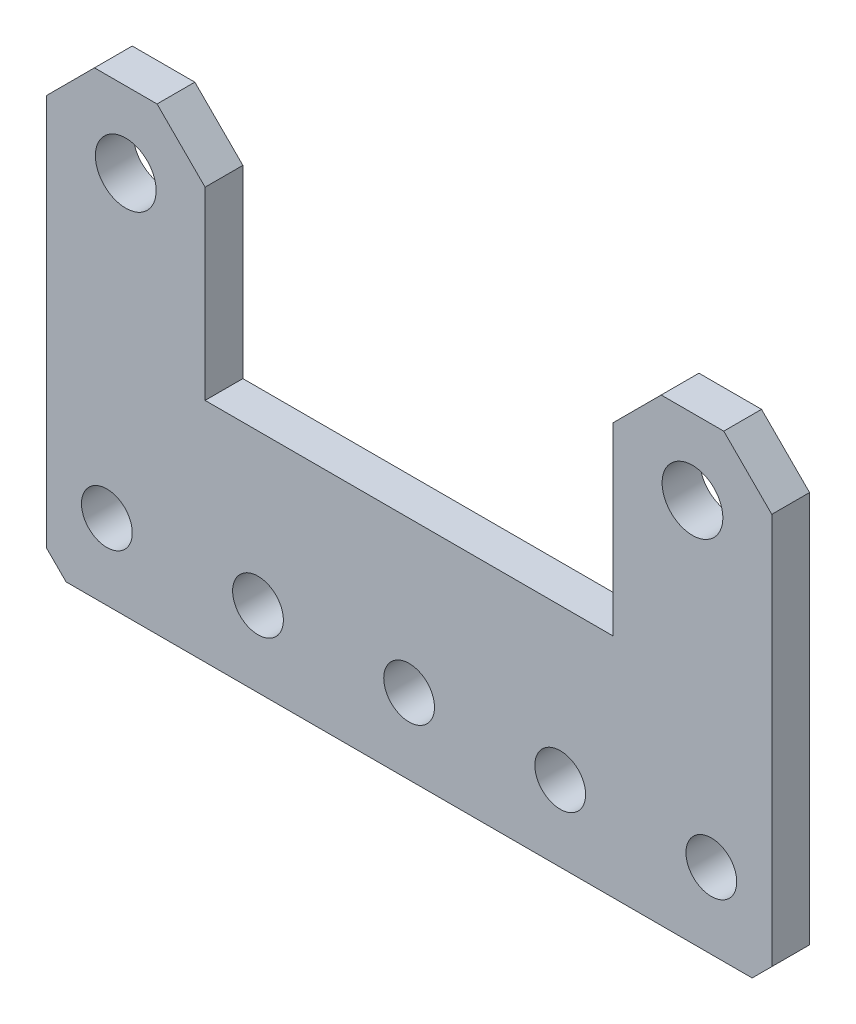
ISO-10303-21;
HEADER;
FILE_DESCRIPTION(('STEP AP214'),'2;1');
FILE_NAME('part.step','',(''),(''),'','','');
FILE_SCHEMA(('AUTOMOTIVE_DESIGN { 1 0 10303 214 1 1 1 1 }'));
ENDSEC;
DATA;
#1=APPLICATION_CONTEXT('core data for automotive mechanical design processes');
#2=APPLICATION_PROTOCOL_DEFINITION('international standard','automotive_design',2000,#1);
#3=PRODUCT_CONTEXT('',#1,'mechanical');
#4=PRODUCT('Part','Part','',(#3));
#5=PRODUCT_RELATED_PRODUCT_CATEGORY('part','',(#4));
#6=PRODUCT_DEFINITION_FORMATION('','',#4);
#7=PRODUCT_DEFINITION_CONTEXT('part definition',#1,'design');
#8=PRODUCT_DEFINITION('design','',#6,#7);
#9=PRODUCT_DEFINITION_SHAPE('','',#8);
#10=(LENGTH_UNIT() NAMED_UNIT(*) SI_UNIT(.MILLI.,.METRE.));
#11=(NAMED_UNIT(*) PLANE_ANGLE_UNIT() SI_UNIT($,.RADIAN.));
#12=(NAMED_UNIT(*) SI_UNIT($,.STERADIAN.) SOLID_ANGLE_UNIT());
#13=UNCERTAINTY_MEASURE_WITH_UNIT(LENGTH_MEASURE(1.E-05),#10,'distance_accuracy_value','');
#14=(GEOMETRIC_REPRESENTATION_CONTEXT(3) GLOBAL_UNCERTAINTY_ASSIGNED_CONTEXT((#13)) GLOBAL_UNIT_ASSIGNED_CONTEXT((#10,
#11,#12)) REPRESENTATION_CONTEXT('',''));
#15=CARTESIAN_POINT('',(0.,0.,0.));
#16=DIRECTION('',(0.,0.,1.));
#17=DIRECTION('',(1.,0.,0.));
#18=AXIS2_PLACEMENT_3D('',#15,#16,#17);
#19=CARTESIAN_POINT('',(0.,0.,0.));
#20=DIRECTION('',(0.,0.,1.));
#21=DIRECTION('',(1.,0.,0.));
#22=AXIS2_PLACEMENT_3D('',#19,#20,#21);
#23=PLANE('',#22);
#24=CARTESIAN_POINT('',(25.4,-12.7,0.));
#25=DIRECTION('',(0.,0.,-1.));
#26=DIRECTION('',(-1.,0.,0.));
#27=AXIS2_PLACEMENT_3D('',#24,#25,#26);
#28=CIRCLE('',#27,2.1336);
#29=CARTESIAN_POINT('',(23.2664,-12.7,0.));
#30=VERTEX_POINT('',#29);
#31=EDGE_CURVE('E163',#30,#30,#28,.F.);
#32=ORIENTED_EDGE('',*,*,#31,.T.);
#33=EDGE_LOOP('',(#32));
#34=FACE_BOUND('',#33,.T.);
#35=CARTESIAN_POINT('',(12.7,-12.7,0.));
#36=DIRECTION('',(0.,0.,-1.));
#37=DIRECTION('',(-1.,0.,0.));
#38=AXIS2_PLACEMENT_3D('',#35,#36,#37);
#39=CIRCLE('',#38,2.1336);
#40=CARTESIAN_POINT('',(10.5664,-12.7,0.));
#41=VERTEX_POINT('',#40);
#42=EDGE_CURVE('E20',#41,#41,#39,.F.);
#43=ORIENTED_EDGE('',*,*,#42,.T.);
#44=EDGE_LOOP('',(#43));
#45=FACE_BOUND('',#44,.T.);
#46=CARTESIAN_POINT('',(0.,-12.7,0.));
#47=DIRECTION('',(0.,0.,-1.));
#48=DIRECTION('',(-1.,0.,0.));
#49=AXIS2_PLACEMENT_3D('',#46,#47,#48);
#50=CIRCLE('',#49,2.1336);
#51=CARTESIAN_POINT('',(-2.1336,-12.7,0.));
#52=VERTEX_POINT('',#51);
#53=EDGE_CURVE('E166',#52,#52,#50,.F.);
#54=ORIENTED_EDGE('',*,*,#53,.T.);
#55=EDGE_LOOP('',(#54));
#56=FACE_BOUND('',#55,.T.);
#57=CARTESIAN_POINT('',(-12.7,-12.7,0.));
#58=DIRECTION('',(0.,0.,-1.));
#59=DIRECTION('',(-1.,0.,0.));
#60=AXIS2_PLACEMENT_3D('',#57,#58,#59);
#61=CIRCLE('',#60,2.1336);
#62=CARTESIAN_POINT('',(-14.8336,-12.7,0.));
#63=VERTEX_POINT('',#62);
#64=EDGE_CURVE('E177',#63,#63,#61,.F.);
#65=ORIENTED_EDGE('',*,*,#64,.T.);
#66=EDGE_LOOP('',(#65));
#67=FACE_BOUND('',#66,.T.);
#68=CARTESIAN_POINT('',(-25.4,-12.7,0.));
#69=DIRECTION('',(0.,0.,-1.));
#70=DIRECTION('',(-1.,0.,0.));
#71=AXIS2_PLACEMENT_3D('',#68,#69,#70);
#72=CIRCLE('',#71,2.1336);
#73=CARTESIAN_POINT('',(-27.5336,-12.7,0.));
#74=VERTEX_POINT('',#73);
#75=EDGE_CURVE('E169',#74,#74,#72,.F.);
#76=ORIENTED_EDGE('',*,*,#75,.T.);
#77=EDGE_LOOP('',(#76));
#78=FACE_BOUND('',#77,.T.);
#79=CARTESIAN_POINT('',(23.8125,13.208,0.));
#80=DIRECTION('',(0.,0.,-1.));
#81=DIRECTION('',(-1.,0.,0.));
#82=AXIS2_PLACEMENT_3D('',#79,#80,#81);
#83=CIRCLE('',#82,2.5527);
#84=CARTESIAN_POINT('',(21.2598,13.208,0.));
#85=VERTEX_POINT('',#84);
#86=EDGE_CURVE('E133',#85,#85,#83,.F.);
#87=ORIENTED_EDGE('',*,*,#86,.T.);
#88=EDGE_LOOP('',(#87));
#89=FACE_BOUND('',#88,.T.);
#90=CARTESIAN_POINT('',(-23.8125,13.208,0.));
#91=DIRECTION('',(0.,0.,-1.));
#92=DIRECTION('',(-1.,0.,0.));
#93=AXIS2_PLACEMENT_3D('',#90,#91,#92);
#94=CIRCLE('',#93,2.5527);
#95=CARTESIAN_POINT('',(-26.3652,13.208,0.));
#96=VERTEX_POINT('',#95);
#97=EDGE_CURVE('E172',#96,#96,#94,.F.);
#98=ORIENTED_EDGE('',*,*,#97,.T.);
#99=EDGE_LOOP('',(#98));
#100=FACE_BOUND('',#99,.T.);
#101=DIRECTION('',(-0.707106781186545,0.70710678118655,0.));
#102=VECTOR('',#101,1.);
#103=CARTESIAN_POINT('',(-28.829,-19.05,0.));
#104=LINE('',#103,#102);
#105=CARTESIAN_POINT('',(-28.829,-19.05,0.));
#106=VERTEX_POINT('',#105);
#107=CARTESIAN_POINT('',(-30.48,-17.399,0.));
#108=VERTEX_POINT('',#107);
#109=EDGE_CURVE('E117',#106,#108,#104,.T.);
#110=ORIENTED_EDGE('',*,*,#109,.T.);
#111=DIRECTION('',(0.,1.,0.));
#112=VECTOR('',#111,1.);
#113=CARTESIAN_POINT('',(-30.48,15.5207561210691,0.));
#114=LINE('',#113,#112);
#115=CARTESIAN_POINT('',(-30.48,15.5207561210691,0.));
#116=VERTEX_POINT('',#115);
#117=EDGE_CURVE('E120',#108,#116,#114,.T.);
#118=ORIENTED_EDGE('',*,*,#117,.T.);
#119=DIRECTION('',(0.707106781186544,0.707106781186551,0.));
#120=VECTOR('',#119,1.);
#121=CARTESIAN_POINT('',(-26.4427561210692,19.558,0.));
#122=LINE('',#121,#120);
#123=CARTESIAN_POINT('',(-26.4427561210692,19.558,0.));
#124=VERTEX_POINT('',#123);
#125=EDGE_CURVE('E175',#116,#124,#122,.T.);
#126=ORIENTED_EDGE('',*,*,#125,.T.);
#127=DIRECTION('',(1.,0.,0.));
#128=VECTOR('',#127,1.);
#129=CARTESIAN_POINT('',(-21.1822438789308,19.558,0.));
#130=LINE('',#129,#128);
#131=CARTESIAN_POINT('',(-21.1822438789308,19.558,0.));
#132=VERTEX_POINT('',#131);
#133=EDGE_CURVE('E480',#124,#132,#130,.T.);
#134=ORIENTED_EDGE('',*,*,#133,.T.);
#135=DIRECTION('',(0.707106781186546,-0.707106781186549,0.));
#136=VECTOR('',#135,1.);
#137=CARTESIAN_POINT('',(-21.1822438789308,19.558,0.));
#138=LINE('',#137,#136);
#139=CARTESIAN_POINT('',(-17.145,15.5207561210691,0.));
#140=VERTEX_POINT('',#139);
#141=EDGE_CURVE('E475',#132,#140,#138,.T.);
#142=ORIENTED_EDGE('',*,*,#141,.T.);
#143=DIRECTION('',(0.,1.,0.));
#144=VECTOR('',#143,1.);
#145=CARTESIAN_POINT('',(-17.145,15.5207561210691,0.));
#146=LINE('',#145,#144);
#147=CARTESIAN_POINT('',(-17.145,0.,0.));
#148=VERTEX_POINT('',#147);
#149=EDGE_CURVE('E470',#140,#148,#146,.F.);
#150=ORIENTED_EDGE('',*,*,#149,.T.);
#151=DIRECTION('',(1.,0.,0.));
#152=VECTOR('',#151,1.);
#153=CARTESIAN_POINT('',(-17.145,0.,0.));
#154=LINE('',#153,#152);
#155=CARTESIAN_POINT('',(17.145,0.,0.));
#156=VERTEX_POINT('',#155);
#157=EDGE_CURVE('E465',#148,#156,#154,.T.);
#158=ORIENTED_EDGE('',*,*,#157,.T.);
#159=DIRECTION('',(0.,1.,0.));
#160=VECTOR('',#159,1.);
#161=CARTESIAN_POINT('',(17.145,0.,0.));
#162=LINE('',#161,#160);
#163=CARTESIAN_POINT('',(17.145,15.5207561210692,0.));
#164=VERTEX_POINT('',#163);
#165=EDGE_CURVE('E460',#156,#164,#162,.T.);
#166=ORIENTED_EDGE('',*,*,#165,.T.);
#167=DIRECTION('',(0.707106781186547,0.707106781186548,0.));
#168=VECTOR('',#167,1.);
#169=CARTESIAN_POINT('',(17.145,15.5207561210692,0.));
#170=LINE('',#169,#168);
#171=CARTESIAN_POINT('',(21.1822438789308,19.558,0.));
#172=VERTEX_POINT('',#171);
#173=EDGE_CURVE('E455',#164,#172,#170,.T.);
#174=ORIENTED_EDGE('',*,*,#173,.T.);
#175=DIRECTION('',(1.,0.,0.));
#176=VECTOR('',#175,1.);
#177=CARTESIAN_POINT('',(26.4427561210692,19.558,0.));
#178=LINE('',#177,#176);
#179=CARTESIAN_POINT('',(26.4427561210692,19.558,0.));
#180=VERTEX_POINT('',#179);
#181=EDGE_CURVE('E450',#172,#180,#178,.T.);
#182=ORIENTED_EDGE('',*,*,#181,.T.);
#183=DIRECTION('',(0.707106781186544,-0.707106781186551,0.));
#184=VECTOR('',#183,1.);
#185=CARTESIAN_POINT('',(30.48,15.5207561210691,0.));
#186=LINE('',#185,#184);
#187=CARTESIAN_POINT('',(30.48,15.5207561210691,0.));
#188=VERTEX_POINT('',#187);
#189=EDGE_CURVE('E445',#180,#188,#186,.T.);
#190=ORIENTED_EDGE('',*,*,#189,.T.);
#191=DIRECTION('',(0.,-1.,0.));
#192=VECTOR('',#191,1.);
#193=CARTESIAN_POINT('',(30.48,-19.05,0.));
#194=LINE('',#193,#192);
#195=CARTESIAN_POINT('',(30.48,-17.399,0.));
#196=VERTEX_POINT('',#195);
#197=EDGE_CURVE('E439',#188,#196,#194,.T.);
#198=ORIENTED_EDGE('',*,*,#197,.T.);
#199=DIRECTION('',(-0.70710678118655,-0.707106781186545,0.));
#200=VECTOR('',#199,1.);
#201=CARTESIAN_POINT('',(30.48,-17.399,0.));
#202=LINE('',#201,#200);
#203=CARTESIAN_POINT('',(28.829,-19.05,0.));
#204=VERTEX_POINT('',#203);
#205=EDGE_CURVE('E434',#196,#204,#202,.T.);
#206=ORIENTED_EDGE('',*,*,#205,.T.);
#207=DIRECTION('',(1.,0.,0.));
#208=VECTOR('',#207,1.);
#209=CARTESIAN_POINT('',(-30.48,-19.05,0.));
#210=LINE('',#209,#208);
#211=EDGE_CURVE('E115',#204,#106,#210,.F.);
#212=ORIENTED_EDGE('',*,*,#211,.T.);
#213=EDGE_LOOP('',(#110,#118,#126,#134,#142,#150,#158,#166,#174,#182,#190,#198,#206,#212));
#214=FACE_BOUND('',#213,.T.);
#215=ADVANCED_FACE('F17',(#34,#45,#56,#67,#78,#89,#100,#214),#23,.F.);
#216=CARTESIAN_POINT('',(12.7,-12.7,3.175));
#217=DIRECTION('',(0.,0.,-1.));
#218=DIRECTION('',(-1.,0.,0.));
#219=AXIS2_PLACEMENT_3D('',#216,#217,#218);
#220=CYLINDRICAL_SURFACE('',#219,2.1336);
#221=CARTESIAN_POINT('',(12.7,-12.7,3.175));
#222=DIRECTION('',(0.,0.,-1.));
#223=DIRECTION('',(-1.,0.,0.));
#224=AXIS2_PLACEMENT_3D('',#221,#222,#223);
#225=CIRCLE('',#224,2.1336);
#226=CARTESIAN_POINT('',(10.5664,-12.7,3.175));
#227=VERTEX_POINT('',#226);
#228=EDGE_CURVE('E160',#227,#227,#225,.T.);
#229=ORIENTED_EDGE('',*,*,#228,.F.);
#230=EDGE_LOOP('',(#229));
#231=FACE_BOUND('',#230,.T.);
#232=ORIENTED_EDGE('',*,*,#42,.F.);
#233=EDGE_LOOP('',(#232));
#234=FACE_BOUND('',#233,.T.);
#235=ADVANCED_FACE('F186',(#231,#234),#220,.F.);
#236=CARTESIAN_POINT('',(-12.7,-12.7,3.175));
#237=DIRECTION('',(0.,0.,-1.));
#238=DIRECTION('',(-1.,0.,0.));
#239=AXIS2_PLACEMENT_3D('',#236,#237,#238);
#240=CYLINDRICAL_SURFACE('',#239,2.1336);
#241=CARTESIAN_POINT('',(-12.7,-12.7,3.175));
#242=DIRECTION('',(0.,0.,-1.));
#243=DIRECTION('',(-1.,0.,0.));
#244=AXIS2_PLACEMENT_3D('',#241,#242,#243);
#245=CIRCLE('',#244,2.1336);
#246=CARTESIAN_POINT('',(-14.8336,-12.7,3.175));
#247=VERTEX_POINT('',#246);
#248=EDGE_CURVE('E157',#247,#247,#245,.T.);
#249=ORIENTED_EDGE('',*,*,#248,.F.);
#250=EDGE_LOOP('',(#249));
#251=FACE_BOUND('',#250,.T.);
#252=ORIENTED_EDGE('',*,*,#64,.F.);
#253=EDGE_LOOP('',(#252));
#254=FACE_BOUND('',#253,.T.);
#255=ADVANCED_FACE('F188',(#251,#254),#240,.F.);
#256=CARTESIAN_POINT('',(23.8125,13.208,3.175));
#257=DIRECTION('',(0.,0.,-1.));
#258=DIRECTION('',(-1.,0.,0.));
#259=AXIS2_PLACEMENT_3D('',#256,#257,#258);
#260=CYLINDRICAL_SURFACE('',#259,2.5527);
#261=CARTESIAN_POINT('',(23.8125,13.208,3.175));
#262=DIRECTION('',(0.,0.,-1.));
#263=DIRECTION('',(-1.,0.,0.));
#264=AXIS2_PLACEMENT_3D('',#261,#262,#263);
#265=CIRCLE('',#264,2.5527);
#266=CARTESIAN_POINT('',(21.2598,13.208,3.175));
#267=VERTEX_POINT('',#266);
#268=EDGE_CURVE('E153',#267,#267,#265,.T.);
#269=ORIENTED_EDGE('',*,*,#268,.F.);
#270=EDGE_LOOP('',(#269));
#271=FACE_BOUND('',#270,.T.);
#272=ORIENTED_EDGE('',*,*,#86,.F.);
#273=EDGE_LOOP('',(#272));
#274=FACE_BOUND('',#273,.T.);
#275=ADVANCED_FACE('F195',(#271,#274),#260,.F.);
#276=CARTESIAN_POINT('',(-30.48,15.5207561210691,3.175));
#277=DIRECTION('',(1.,0.,0.));
#278=DIRECTION('',(0.,1.,0.));
#279=AXIS2_PLACEMENT_3D('',#276,#277,#278);
#280=PLANE('',#279);
#281=DIRECTION('',(0.,0.,1.));
#282=VECTOR('',#281,1.);
#283=CARTESIAN_POINT('',(-30.48,-17.399,3.175));
#284=LINE('',#283,#282);
#285=CARTESIAN_POINT('',(-30.48,-17.399,3.175));
#286=VERTEX_POINT('',#285);
#287=EDGE_CURVE('E125',#108,#286,#284,.T.);
#288=ORIENTED_EDGE('',*,*,#287,.T.);
#289=DIRECTION('',(0.,1.,0.));
#290=VECTOR('',#289,1.);
#291=CARTESIAN_POINT('',(-30.48,0.,3.175));
#292=LINE('',#291,#290);
#293=CARTESIAN_POINT('',(-30.48,15.5207561210691,3.175));
#294=VERTEX_POINT('',#293);
#295=EDGE_CURVE('E156',#294,#286,#292,.F.);
#296=ORIENTED_EDGE('',*,*,#295,.F.);
#297=DIRECTION('',(0.,0.,1.));
#298=VECTOR('',#297,1.);
#299=CARTESIAN_POINT('',(-30.48,15.5207561210691,3.175));
#300=LINE('',#299,#298);
#301=EDGE_CURVE('E131',#294,#116,#300,.F.);
#302=ORIENTED_EDGE('',*,*,#301,.T.);
#303=ORIENTED_EDGE('',*,*,#117,.F.);
#304=EDGE_LOOP('',(#288,#296,#302,#303));
#305=FACE_BOUND('',#304,.T.);
#306=ADVANCED_FACE('F128',(#305),#280,.F.);
#307=CARTESIAN_POINT('',(-28.829,-19.05,3.175));
#308=DIRECTION('',(0.70710678118655,0.707106781186545,0.));
#309=DIRECTION('',(-0.707106781186545,0.70710678118655,0.));
#310=AXIS2_PLACEMENT_3D('',#307,#308,#309);
#311=PLANE('',#310);
#312=ORIENTED_EDGE('',*,*,#287,.F.);
#313=ORIENTED_EDGE('',*,*,#109,.F.);
#314=DIRECTION('',(0.,0.,1.));
#315=VECTOR('',#314,1.);
#316=CARTESIAN_POINT('',(-28.829,-19.05,3.175));
#317=LINE('',#316,#315);
#318=CARTESIAN_POINT('',(-28.829,-19.05,3.175));
#319=VERTEX_POINT('',#318);
#320=EDGE_CURVE('E140',#106,#319,#317,.T.);
#321=ORIENTED_EDGE('',*,*,#320,.T.);
#322=DIRECTION('',(0.707106781186545,-0.70710678118655,0.));
#323=VECTOR('',#322,1.);
#324=CARTESIAN_POINT('',(-30.48,-17.399,3.175));
#325=LINE('',#324,#323);
#326=EDGE_CURVE('E137',#286,#319,#325,.T.);
#327=ORIENTED_EDGE('',*,*,#326,.F.);
#328=EDGE_LOOP('',(#312,#313,#321,#327));
#329=FACE_BOUND('',#328,.T.);
#330=ADVANCED_FACE('F135',(#329),#311,.F.);
#331=CARTESIAN_POINT('',(-30.48,-19.05,3.175));
#332=DIRECTION('',(0.,1.,0.));
#333=DIRECTION('',(0.,0.,1.));
#334=AXIS2_PLACEMENT_3D('',#331,#332,#333);
#335=PLANE('',#334);
#336=ORIENTED_EDGE('',*,*,#320,.F.);
#337=ORIENTED_EDGE('',*,*,#211,.F.);
#338=DIRECTION('',(0.,0.,1.));
#339=VECTOR('',#338,1.);
#340=CARTESIAN_POINT('',(28.829,-19.05,3.175));
#341=LINE('',#340,#339);
#342=CARTESIAN_POINT('',(28.829,-19.05,3.175));
#343=VERTEX_POINT('',#342);
#344=EDGE_CURVE('E435',#204,#343,#341,.T.);
#345=ORIENTED_EDGE('',*,*,#344,.T.);
#346=DIRECTION('',(1.,0.,0.));
#347=VECTOR('',#346,1.);
#348=CARTESIAN_POINT('',(0.,-19.05,3.175));
#349=LINE('',#348,#347);
#350=EDGE_CURVE('E433',#319,#343,#349,.T.);
#351=ORIENTED_EDGE('',*,*,#350,.F.);
#352=EDGE_LOOP('',(#336,#337,#345,#351));
#353=FACE_BOUND('',#352,.T.);
#354=ADVANCED_FACE('F266',(#353),#335,.F.);
#355=CARTESIAN_POINT('',(30.48,-17.399,3.175));
#356=DIRECTION('',(-0.707106781186545,0.70710678118655,0.));
#357=DIRECTION('',(-0.70710678118655,-0.707106781186545,0.));
#358=AXIS2_PLACEMENT_3D('',#355,#356,#357);
#359=PLANE('',#358);
#360=ORIENTED_EDGE('',*,*,#344,.F.);
#361=ORIENTED_EDGE('',*,*,#205,.F.);
#362=DIRECTION('',(0.,0.,1.));
#363=VECTOR('',#362,1.);
#364=CARTESIAN_POINT('',(30.48,-17.399,3.175));
#365=LINE('',#364,#363);
#366=CARTESIAN_POINT('',(30.48,-17.399,3.175));
#367=VERTEX_POINT('',#366);
#368=EDGE_CURVE('E441',#196,#367,#365,.T.);
#369=ORIENTED_EDGE('',*,*,#368,.T.);
#370=DIRECTION('',(0.707106781186553,0.707106781186542,0.));
#371=VECTOR('',#370,1.);
#372=CARTESIAN_POINT('',(28.829,-19.05,3.175));
#373=LINE('',#372,#371);
#374=EDGE_CURVE('E489',#343,#367,#373,.T.);
#375=ORIENTED_EDGE('',*,*,#374,.F.);
#376=EDGE_LOOP('',(#360,#361,#369,#375));
#377=FACE_BOUND('',#376,.T.);
#378=ADVANCED_FACE('F262',(#377),#359,.F.);
#379=CARTESIAN_POINT('',(30.48,-19.05,3.175));
#380=DIRECTION('',(-1.,0.,0.));
#381=DIRECTION('',(0.,-1.,0.));
#382=AXIS2_PLACEMENT_3D('',#379,#380,#381);
#383=PLANE('',#382);
#384=ORIENTED_EDGE('',*,*,#368,.F.);
#385=ORIENTED_EDGE('',*,*,#197,.F.);
#386=DIRECTION('',(0.,0.,1.));
#387=VECTOR('',#386,1.);
#388=CARTESIAN_POINT('',(30.48,15.5207561210691,3.175));
#389=LINE('',#388,#387);
#390=CARTESIAN_POINT('',(30.48,15.5207561210691,3.175));
#391=VERTEX_POINT('',#390);
#392=EDGE_CURVE('E443',#188,#391,#389,.T.);
#393=ORIENTED_EDGE('',*,*,#392,.T.);
#394=DIRECTION('',(0.,1.,0.));
#395=VECTOR('',#394,1.);
#396=CARTESIAN_POINT('',(30.48,0.,3.175));
#397=LINE('',#396,#395);
#398=EDGE_CURVE('E492',#367,#391,#397,.T.);
#399=ORIENTED_EDGE('',*,*,#398,.F.);
#400=EDGE_LOOP('',(#384,#385,#393,#399));
#401=FACE_BOUND('',#400,.T.);
#402=ADVANCED_FACE('F258',(#401),#383,.F.);
#403=CARTESIAN_POINT('',(30.48,15.5207561210691,3.175));
#404=DIRECTION('',(-0.707106781186551,-0.707106781186544,0.));
#405=DIRECTION('',(0.707106781186544,-0.707106781186551,0.));
#406=AXIS2_PLACEMENT_3D('',#403,#404,#405);
#407=PLANE('',#406);
#408=DIRECTION('',(0.,0.,1.));
#409=VECTOR('',#408,1.);
#410=CARTESIAN_POINT('',(26.4427561210692,19.558,3.175));
#411=LINE('',#410,#409);
#412=CARTESIAN_POINT('',(26.4427561210692,19.558,3.175));
#413=VERTEX_POINT('',#412);
#414=EDGE_CURVE('E448',#180,#413,#411,.T.);
#415=ORIENTED_EDGE('',*,*,#414,.T.);
#416=DIRECTION('',(-0.707106781186544,0.707106781186551,0.));
#417=VECTOR('',#416,1.);
#418=CARTESIAN_POINT('',(30.48,15.5207561210691,3.175));
#419=LINE('',#418,#417);
#420=EDGE_CURVE('E495',#391,#413,#419,.T.);
#421=ORIENTED_EDGE('',*,*,#420,.F.);
#422=ORIENTED_EDGE('',*,*,#392,.F.);
#423=ORIENTED_EDGE('',*,*,#189,.F.);
#424=EDGE_LOOP('',(#415,#421,#422,#423));
#425=FACE_BOUND('',#424,.T.);
#426=ADVANCED_FACE('F254',(#425),#407,.F.);
#427=CARTESIAN_POINT('',(26.4427561210692,19.558,3.175));
#428=DIRECTION('',(0.,-1.,0.));
#429=DIRECTION('',(1.,0.,0.));
#430=AXIS2_PLACEMENT_3D('',#427,#428,#429);
#431=PLANE('',#430);
#432=DIRECTION('',(0.,0.,1.));
#433=VECTOR('',#432,1.);
#434=CARTESIAN_POINT('',(21.1822438789308,19.558,3.175));
#435=LINE('',#434,#433);
#436=CARTESIAN_POINT('',(21.1822438789308,19.558,3.175));
#437=VERTEX_POINT('',#436);
#438=EDGE_CURVE('E453',#172,#437,#435,.T.);
#439=ORIENTED_EDGE('',*,*,#438,.T.);
#440=DIRECTION('',(1.,0.,0.));
#441=VECTOR('',#440,1.);
#442=CARTESIAN_POINT('',(0.,19.558,3.175));
#443=LINE('',#442,#441);
#444=EDGE_CURVE('E498',#413,#437,#443,.F.);
#445=ORIENTED_EDGE('',*,*,#444,.F.);
#446=ORIENTED_EDGE('',*,*,#414,.F.);
#447=ORIENTED_EDGE('',*,*,#181,.F.);
#448=EDGE_LOOP('',(#439,#445,#446,#447));
#449=FACE_BOUND('',#448,.T.);
#450=ADVANCED_FACE('F250',(#449),#431,.F.);
#451=CARTESIAN_POINT('',(17.145,15.5207561210692,3.175));
#452=DIRECTION('',(0.707106781186548,-0.707106781186547,0.));
#453=DIRECTION('',(0.707106781186547,0.707106781186548,0.));
#454=AXIS2_PLACEMENT_3D('',#451,#452,#453);
#455=PLANE('',#454);
#456=DIRECTION('',(0.,0.,-1.));
#457=VECTOR('',#456,1.);
#458=CARTESIAN_POINT('',(17.145,15.5207561210692,3.175));
#459=LINE('',#458,#457);
#460=CARTESIAN_POINT('',(17.145,15.5207561210692,3.175));
#461=VERTEX_POINT('',#460);
#462=EDGE_CURVE('E458',#164,#461,#459,.F.);
#463=ORIENTED_EDGE('',*,*,#462,.T.);
#464=DIRECTION('',(-0.707106781186547,-0.707106781186548,0.));
#465=VECTOR('',#464,1.);
#466=CARTESIAN_POINT('',(21.1822438789308,19.558,3.175));
#467=LINE('',#466,#465);
#468=EDGE_CURVE('E501',#437,#461,#467,.T.);
#469=ORIENTED_EDGE('',*,*,#468,.F.);
#470=ORIENTED_EDGE('',*,*,#438,.F.);
#471=ORIENTED_EDGE('',*,*,#173,.F.);
#472=EDGE_LOOP('',(#463,#469,#470,#471));
#473=FACE_BOUND('',#472,.T.);
#474=ADVANCED_FACE('F246',(#473),#455,.F.);
#475=CARTESIAN_POINT('',(17.145,0.,3.175));
#476=DIRECTION('',(1.,0.,0.));
#477=DIRECTION('',(0.,0.,-1.));
#478=AXIS2_PLACEMENT_3D('',#475,#476,#477);
#479=PLANE('',#478);
#480=DIRECTION('',(0.,0.,-1.));
#481=VECTOR('',#480,1.);
#482=CARTESIAN_POINT('',(17.145,0.,3.175));
#483=LINE('',#482,#481);
#484=CARTESIAN_POINT('',(17.145,0.,3.175));
#485=VERTEX_POINT('',#484);
#486=EDGE_CURVE('E463',#156,#485,#483,.F.);
#487=ORIENTED_EDGE('',*,*,#486,.T.);
#488=DIRECTION('',(0.,1.,0.));
#489=VECTOR('',#488,1.);
#490=CARTESIAN_POINT('',(17.145,0.,3.175));
#491=LINE('',#490,#489);
#492=EDGE_CURVE('E504',#461,#485,#491,.F.);
#493=ORIENTED_EDGE('',*,*,#492,.F.);
#494=ORIENTED_EDGE('',*,*,#462,.F.);
#495=ORIENTED_EDGE('',*,*,#165,.F.);
#496=EDGE_LOOP('',(#487,#493,#494,#495));
#497=FACE_BOUND('',#496,.T.);
#498=ADVANCED_FACE('F242',(#497),#479,.F.);
#499=CARTESIAN_POINT('',(-17.145,0.,3.175));
#500=DIRECTION('',(0.,-1.,0.));
#501=DIRECTION('',(0.,0.,-1.));
#502=AXIS2_PLACEMENT_3D('',#499,#500,#501);
#503=PLANE('',#502);
#504=DIRECTION('',(0.,0.,1.));
#505=VECTOR('',#504,1.);
#506=CARTESIAN_POINT('',(-17.145,0.,3.175));
#507=LINE('',#506,#505);
#508=CARTESIAN_POINT('',(-17.145,0.,3.175));
#509=VERTEX_POINT('',#508);
#510=EDGE_CURVE('E468',#148,#509,#507,.T.);
#511=ORIENTED_EDGE('',*,*,#510,.T.);
#512=DIRECTION('',(1.,0.,0.));
#513=VECTOR('',#512,1.);
#514=CARTESIAN_POINT('',(0.,0.,3.175));
#515=LINE('',#514,#513);
#516=EDGE_CURVE('E507',#485,#509,#515,.F.);
#517=ORIENTED_EDGE('',*,*,#516,.F.);
#518=ORIENTED_EDGE('',*,*,#486,.F.);
#519=ORIENTED_EDGE('',*,*,#157,.F.);
#520=EDGE_LOOP('',(#511,#517,#518,#519));
#521=FACE_BOUND('',#520,.T.);
#522=ADVANCED_FACE('F238',(#521),#503,.F.);
#523=CARTESIAN_POINT('',(-17.145,15.5207561210691,3.175));
#524=DIRECTION('',(-1.,0.,0.));
#525=DIRECTION('',(0.,0.,1.));
#526=AXIS2_PLACEMENT_3D('',#523,#524,#525);
#527=PLANE('',#526);
#528=DIRECTION('',(0.,0.,1.));
#529=VECTOR('',#528,1.);
#530=CARTESIAN_POINT('',(-17.145,15.5207561210691,3.175));
#531=LINE('',#530,#529);
#532=CARTESIAN_POINT('',(-17.145,15.5207561210691,3.175));
#533=VERTEX_POINT('',#532);
#534=EDGE_CURVE('E473',#140,#533,#531,.T.);
#535=ORIENTED_EDGE('',*,*,#534,.T.);
#536=DIRECTION('',(0.,1.,0.));
#537=VECTOR('',#536,1.);
#538=CARTESIAN_POINT('',(-17.145,0.,3.175));
#539=LINE('',#538,#537);
#540=EDGE_CURVE('E510',#509,#533,#539,.T.);
#541=ORIENTED_EDGE('',*,*,#540,.F.);
#542=ORIENTED_EDGE('',*,*,#510,.F.);
#543=ORIENTED_EDGE('',*,*,#149,.F.);
#544=EDGE_LOOP('',(#535,#541,#542,#543));
#545=FACE_BOUND('',#544,.T.);
#546=ADVANCED_FACE('F234',(#545),#527,.F.);
#547=CARTESIAN_POINT('',(-21.1822438789308,19.558,3.175));
#548=DIRECTION('',(-0.707106781186549,-0.707106781186546,0.));
#549=DIRECTION('',(0.707106781186546,-0.707106781186549,0.));
#550=AXIS2_PLACEMENT_3D('',#547,#548,#549);
#551=PLANE('',#550);
#552=DIRECTION('',(0.,0.,-1.));
#553=VECTOR('',#552,1.);
#554=CARTESIAN_POINT('',(-21.1822438789308,19.558,3.175));
#555=LINE('',#554,#553);
#556=CARTESIAN_POINT('',(-21.1822438789308,19.558,3.175));
#557=VERTEX_POINT('',#556);
#558=EDGE_CURVE('E478',#132,#557,#555,.F.);
#559=ORIENTED_EDGE('',*,*,#558,.T.);
#560=DIRECTION('',(-0.707106781186546,0.707106781186549,0.));
#561=VECTOR('',#560,1.);
#562=CARTESIAN_POINT('',(-17.145,15.5207561210691,3.175));
#563=LINE('',#562,#561);
#564=EDGE_CURVE('E513',#533,#557,#563,.T.);
#565=ORIENTED_EDGE('',*,*,#564,.F.);
#566=ORIENTED_EDGE('',*,*,#534,.F.);
#567=ORIENTED_EDGE('',*,*,#141,.F.);
#568=EDGE_LOOP('',(#559,#565,#566,#567));
#569=FACE_BOUND('',#568,.T.);
#570=ADVANCED_FACE('F231',(#569),#551,.F.);
#571=CARTESIAN_POINT('',(-21.1822438789308,19.558,3.175));
#572=DIRECTION('',(0.,-1.,0.));
#573=DIRECTION('',(0.,0.,-1.));
#574=AXIS2_PLACEMENT_3D('',#571,#572,#573);
#575=PLANE('',#574);
#576=DIRECTION('',(0.,0.,1.));
#577=VECTOR('',#576,1.);
#578=CARTESIAN_POINT('',(-26.4427561210692,19.558,3.175));
#579=LINE('',#578,#577);
#580=CARTESIAN_POINT('',(-26.4427561210692,19.558,3.175));
#581=VERTEX_POINT('',#580);
#582=EDGE_CURVE('E35',#124,#581,#579,.T.);
#583=ORIENTED_EDGE('',*,*,#582,.T.);
#584=DIRECTION('',(1.,0.,0.));
#585=VECTOR('',#584,1.);
#586=CARTESIAN_POINT('',(0.,19.558,3.175));
#587=LINE('',#586,#585);
#588=EDGE_CURVE('E516',#557,#581,#587,.F.);
#589=ORIENTED_EDGE('',*,*,#588,.F.);
#590=ORIENTED_EDGE('',*,*,#558,.F.);
#591=ORIENTED_EDGE('',*,*,#133,.F.);
#592=EDGE_LOOP('',(#583,#589,#590,#591));
#593=FACE_BOUND('',#592,.T.);
#594=ADVANCED_FACE('F227',(#593),#575,.F.);
#595=CARTESIAN_POINT('',(-26.4427561210692,19.558,3.175));
#596=DIRECTION('',(0.707106781186551,-0.707106781186544,0.));
#597=DIRECTION('',(0.707106781186544,0.707106781186551,0.));
#598=AXIS2_PLACEMENT_3D('',#595,#596,#597);
#599=PLANE('',#598);
#600=ORIENTED_EDGE('',*,*,#301,.F.);
#601=DIRECTION('',(-0.707106781186544,-0.707106781186551,0.));
#602=VECTOR('',#601,1.);
#603=CARTESIAN_POINT('',(-26.4427561210692,19.558,3.175));
#604=LINE('',#603,#602);
#605=EDGE_CURVE('E152',#581,#294,#604,.T.);
#606=ORIENTED_EDGE('',*,*,#605,.F.);
#607=ORIENTED_EDGE('',*,*,#582,.F.);
#608=ORIENTED_EDGE('',*,*,#125,.F.);
#609=EDGE_LOOP('',(#600,#606,#607,#608));
#610=FACE_BOUND('',#609,.T.);
#611=ADVANCED_FACE('F223',(#610),#599,.F.);
#612=CARTESIAN_POINT('',(-23.8125,13.208,3.175));
#613=DIRECTION('',(0.,0.,-1.));
#614=DIRECTION('',(-1.,0.,0.));
#615=AXIS2_PLACEMENT_3D('',#612,#613,#614);
#616=CYLINDRICAL_SURFACE('',#615,2.5527);
#617=CARTESIAN_POINT('',(-23.8125,13.208,3.175));
#618=DIRECTION('',(0.,0.,-1.));
#619=DIRECTION('',(-1.,0.,0.));
#620=AXIS2_PLACEMENT_3D('',#617,#618,#619);
#621=CIRCLE('',#620,2.5527);
#622=CARTESIAN_POINT('',(-26.3652,13.208,3.175));
#623=VERTEX_POINT('',#622);
#624=EDGE_CURVE('E149',#623,#623,#621,.T.);
#625=ORIENTED_EDGE('',*,*,#624,.F.);
#626=EDGE_LOOP('',(#625));
#627=FACE_BOUND('',#626,.T.);
#628=ORIENTED_EDGE('',*,*,#97,.F.);
#629=EDGE_LOOP('',(#628));
#630=FACE_BOUND('',#629,.T.);
#631=ADVANCED_FACE('F219',(#627,#630),#616,.F.);
#632=CARTESIAN_POINT('',(-25.4,-12.7,3.175));
#633=DIRECTION('',(0.,0.,-1.));
#634=DIRECTION('',(-1.,0.,0.));
#635=AXIS2_PLACEMENT_3D('',#632,#633,#634);
#636=CYLINDRICAL_SURFACE('',#635,2.1336);
#637=CARTESIAN_POINT('',(-25.4,-12.7,3.175));
#638=DIRECTION('',(0.,0.,-1.));
#639=DIRECTION('',(-1.,0.,0.));
#640=AXIS2_PLACEMENT_3D('',#637,#638,#639);
#641=CIRCLE('',#640,2.1336);
#642=CARTESIAN_POINT('',(-27.5336,-12.7,3.175));
#643=VERTEX_POINT('',#642);
#644=EDGE_CURVE('E146',#643,#643,#641,.T.);
#645=ORIENTED_EDGE('',*,*,#644,.F.);
#646=EDGE_LOOP('',(#645));
#647=FACE_BOUND('',#646,.T.);
#648=ORIENTED_EDGE('',*,*,#75,.F.);
#649=EDGE_LOOP('',(#648));
#650=FACE_BOUND('',#649,.T.);
#651=ADVANCED_FACE('F215',(#647,#650),#636,.F.);
#652=CARTESIAN_POINT('',(0.,-12.7,3.175));
#653=DIRECTION('',(0.,0.,-1.));
#654=DIRECTION('',(-1.,0.,0.));
#655=AXIS2_PLACEMENT_3D('',#652,#653,#654);
#656=CYLINDRICAL_SURFACE('',#655,2.1336);
#657=CARTESIAN_POINT('',(0.,-12.7,3.175));
#658=DIRECTION('',(0.,0.,-1.));
#659=DIRECTION('',(-1.,0.,0.));
#660=AXIS2_PLACEMENT_3D('',#657,#658,#659);
#661=CIRCLE('',#660,2.1336);
#662=CARTESIAN_POINT('',(-2.1336,-12.7,3.175));
#663=VERTEX_POINT('',#662);
#664=EDGE_CURVE('E26',#663,#663,#661,.T.);
#665=ORIENTED_EDGE('',*,*,#664,.F.);
#666=EDGE_LOOP('',(#665));
#667=FACE_BOUND('',#666,.T.);
#668=ORIENTED_EDGE('',*,*,#53,.F.);
#669=EDGE_LOOP('',(#668));
#670=FACE_BOUND('',#669,.T.);
#671=ADVANCED_FACE('F208',(#667,#670),#656,.F.);
#672=CARTESIAN_POINT('',(25.4,-12.7,3.175));
#673=DIRECTION('',(0.,0.,-1.));
#674=DIRECTION('',(-1.,0.,0.));
#675=AXIS2_PLACEMENT_3D('',#672,#673,#674);
#676=CYLINDRICAL_SURFACE('',#675,2.1336);
#677=CARTESIAN_POINT('',(25.4,-12.7,3.175));
#678=DIRECTION('',(0.,0.,-1.));
#679=DIRECTION('',(-1.,0.,0.));
#680=AXIS2_PLACEMENT_3D('',#677,#678,#679);
#681=CIRCLE('',#680,2.1336);
#682=CARTESIAN_POINT('',(23.2664,-12.7,3.175));
#683=VERTEX_POINT('',#682);
#684=EDGE_CURVE('E11',#683,#683,#681,.T.);
#685=ORIENTED_EDGE('',*,*,#684,.F.);
#686=EDGE_LOOP('',(#685));
#687=FACE_BOUND('',#686,.T.);
#688=ORIENTED_EDGE('',*,*,#31,.F.);
#689=EDGE_LOOP('',(#688));
#690=FACE_BOUND('',#689,.T.);
#691=ADVANCED_FACE('F202',(#687,#690),#676,.F.);
#692=CARTESIAN_POINT('',(0.,0.,3.175));
#693=DIRECTION('',(0.,0.,1.));
#694=DIRECTION('',(1.,0.,0.));
#695=AXIS2_PLACEMENT_3D('',#692,#693,#694);
#696=PLANE('',#695);
#697=ORIENTED_EDGE('',*,*,#684,.T.);
#698=EDGE_LOOP('',(#697));
#699=FACE_BOUND('',#698,.T.);
#700=ORIENTED_EDGE('',*,*,#664,.T.);
#701=EDGE_LOOP('',(#700));
#702=FACE_BOUND('',#701,.T.);
#703=ORIENTED_EDGE('',*,*,#644,.T.);
#704=EDGE_LOOP('',(#703));
#705=FACE_BOUND('',#704,.T.);
#706=ORIENTED_EDGE('',*,*,#624,.T.);
#707=EDGE_LOOP('',(#706));
#708=FACE_BOUND('',#707,.T.);
#709=ORIENTED_EDGE('',*,*,#588,.T.);
#710=ORIENTED_EDGE('',*,*,#605,.T.);
#711=ORIENTED_EDGE('',*,*,#295,.T.);
#712=ORIENTED_EDGE('',*,*,#326,.T.);
#713=ORIENTED_EDGE('',*,*,#350,.T.);
#714=ORIENTED_EDGE('',*,*,#374,.T.);
#715=ORIENTED_EDGE('',*,*,#398,.T.);
#716=ORIENTED_EDGE('',*,*,#420,.T.);
#717=ORIENTED_EDGE('',*,*,#444,.T.);
#718=ORIENTED_EDGE('',*,*,#468,.T.);
#719=ORIENTED_EDGE('',*,*,#492,.T.);
#720=ORIENTED_EDGE('',*,*,#516,.T.);
#721=ORIENTED_EDGE('',*,*,#540,.T.);
#722=ORIENTED_EDGE('',*,*,#564,.T.);
#723=EDGE_LOOP('',(#709,#710,#711,#712,#713,#714,#715,#716,#717,#718,#719,#720,#721,#722));
#724=FACE_BOUND('',#723,.T.);
#725=ORIENTED_EDGE('',*,*,#268,.T.);
#726=EDGE_LOOP('',(#725));
#727=FACE_BOUND('',#726,.T.);
#728=ORIENTED_EDGE('',*,*,#248,.T.);
#729=EDGE_LOOP('',(#728));
#730=FACE_BOUND('',#729,.T.);
#731=ORIENTED_EDGE('',*,*,#228,.T.);
#732=EDGE_LOOP('',(#731));
#733=FACE_BOUND('',#732,.T.);
#734=ADVANCED_FACE('F200',(#699,#702,#705,#708,#724,#727,#730,#733),#696,.T.);
#735=CLOSED_SHELL('',(#215,#235,#255,#275,#306,#330,#354,#378,#402,#426,#450,#474,#498,#522,
#546,#570,#594,#611,#631,#651,#671,#691,#734));
#736=MANIFOLD_SOLID_BREP('B1',#735);
#737=ADVANCED_BREP_SHAPE_REPRESENTATION('',(#18,#736),#14);
#738=SHAPE_DEFINITION_REPRESENTATION(#9,#737);
ENDSEC;
END-ISO-10303-21;
